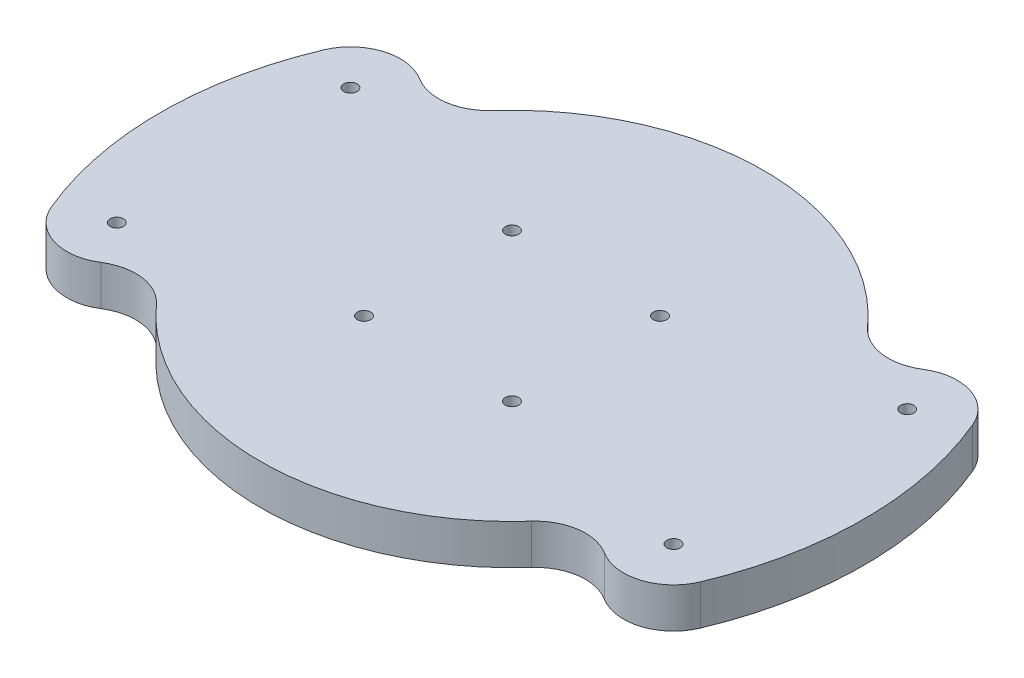
ISO-10303-21;
HEADER;
FILE_DESCRIPTION(('STEP AP214'),'2;1');
FILE_NAME('part.step','',(''),(''),'','','');
FILE_SCHEMA(('AUTOMOTIVE_DESIGN { 1 0 10303 214 1 1 1 1 }'));
ENDSEC;
DATA;
#1=APPLICATION_CONTEXT('core data for automotive mechanical design processes');
#2=APPLICATION_PROTOCOL_DEFINITION('international standard','automotive_design',2000,#1);
#3=PRODUCT_CONTEXT('',#1,'mechanical');
#4=PRODUCT('Part','Part','',(#3));
#5=PRODUCT_RELATED_PRODUCT_CATEGORY('part','',(#4));
#6=PRODUCT_DEFINITION_FORMATION('','',#4);
#7=PRODUCT_DEFINITION_CONTEXT('part definition',#1,'design');
#8=PRODUCT_DEFINITION('design','',#6,#7);
#9=PRODUCT_DEFINITION_SHAPE('','',#8);
#10=(LENGTH_UNIT() NAMED_UNIT(*) SI_UNIT(.MILLI.,.METRE.));
#11=(NAMED_UNIT(*) PLANE_ANGLE_UNIT() SI_UNIT($,.RADIAN.));
#12=(NAMED_UNIT(*) SI_UNIT($,.STERADIAN.) SOLID_ANGLE_UNIT());
#13=UNCERTAINTY_MEASURE_WITH_UNIT(LENGTH_MEASURE(1.E-05),#10,'distance_accuracy_value','');
#14=(GEOMETRIC_REPRESENTATION_CONTEXT(3) GLOBAL_UNCERTAINTY_ASSIGNED_CONTEXT((#13)) GLOBAL_UNIT_ASSIGNED_CONTEXT((#10,
#11,#12)) REPRESENTATION_CONTEXT('',''));
#15=CARTESIAN_POINT('',(0.,0.,0.));
#16=DIRECTION('',(0.,0.,1.));
#17=DIRECTION('',(1.,0.,0.));
#18=AXIS2_PLACEMENT_3D('',#15,#16,#17);
#19=CARTESIAN_POINT('',(0.,6.,0.));
#20=DIRECTION('',(0.,-1.,0.));
#21=DIRECTION('',(0.,0.,-1.));
#22=AXIS2_PLACEMENT_3D('',#19,#20,#21);
#23=PLANE('',#22);
#24=CARTESIAN_POINT('',(-41.7019259147584,6.,-17.5));
#25=DIRECTION('',(0.,1.,0.));
#26=DIRECTION('',(0.,0.,-1.));
#27=AXIS2_PLACEMENT_3D('',#24,#25,#26);
#28=CIRCLE('',#27,0.999999999999998);
#29=CARTESIAN_POINT('',(-41.7019259147584,6.,-18.5));
#30=VERTEX_POINT('',#29);
#31=EDGE_CURVE('E362',#30,#30,#28,.T.);
#32=ORIENTED_EDGE('',*,*,#31,.F.);
#33=EDGE_LOOP('',(#32));
#34=FACE_BOUND('',#33,.T.);
#35=CARTESIAN_POINT('',(-11.0838987950991,6.,11.0838987950992));
#36=DIRECTION('',(0.,1.,0.));
#37=DIRECTION('',(0.,0.,1.));
#38=AXIS2_PLACEMENT_3D('',#35,#36,#37);
#39=CIRCLE('',#38,1.);
#40=CARTESIAN_POINT('',(-11.0838987950991,6.,12.0838987950992));
#41=VERTEX_POINT('',#40);
#42=EDGE_CURVE('E350',#41,#41,#39,.T.);
#43=ORIENTED_EDGE('',*,*,#42,.F.);
#44=EDGE_LOOP('',(#43));
#45=FACE_BOUND('',#44,.T.);
#46=CARTESIAN_POINT('',(11.0838987950991,6.,-11.0838987950992));
#47=DIRECTION('',(0.,1.,0.));
#48=DIRECTION('',(0.,0.,1.));
#49=AXIS2_PLACEMENT_3D('',#46,#47,#48);
#50=CIRCLE('',#49,0.999999999999999);
#51=CARTESIAN_POINT('',(11.0838987950991,6.,-10.0838987950992));
#52=VERTEX_POINT('',#51);
#53=EDGE_CURVE('E337',#52,#52,#50,.T.);
#54=ORIENTED_EDGE('',*,*,#53,.F.);
#55=EDGE_LOOP('',(#54));
#56=FACE_BOUND('',#55,.T.);
#57=CARTESIAN_POINT('',(-11.0838987950992,6.,-11.0838987950991));
#58=DIRECTION('',(0.,1.,0.));
#59=DIRECTION('',(0.,0.,1.));
#60=AXIS2_PLACEMENT_3D('',#57,#58,#59);
#61=CIRCLE('',#60,1.);
#62=CARTESIAN_POINT('',(-11.0838987950992,6.,-10.0838987950991));
#63=VERTEX_POINT('',#62);
#64=EDGE_CURVE('E154',#63,#63,#61,.T.);
#65=ORIENTED_EDGE('',*,*,#64,.F.);
#66=EDGE_LOOP('',(#65));
#67=FACE_BOUND('',#66,.T.);
#68=CARTESIAN_POINT('',(0.,6.,0.));
#69=DIRECTION('',(0.,1.,0.));
#70=DIRECTION('',(0.,0.,1.));
#71=AXIS2_PLACEMENT_3D('',#68,#69,#70);
#72=CIRCLE('',#71,37.725);
#73=CARTESIAN_POINT('',(-28.0981033127079,6.,25.1728467843506));
#74=VERTEX_POINT('',#73);
#75=CARTESIAN_POINT('',(28.0981033127079,6.,25.1728467843506));
#76=VERTEX_POINT('',#75);
#77=EDGE_CURVE('E163',#74,#76,#72,.T.);
#78=ORIENTED_EDGE('',*,*,#77,.T.);
#79=CARTESIAN_POINT('',(33.6842073510197,6.,30.1773888885953));
#80=DIRECTION('',(0.,-1.,0.));
#81=DIRECTION('',(0.,0.,-1.));
#82=AXIS2_PLACEMENT_3D('',#79,#80,#81);
#83=CIRCLE('',#82,7.5);
#84=CARTESIAN_POINT('',(37.693066632889,6.,23.8386944442976));
#85=VERTEX_POINT('',#84);
#86=EDGE_CURVE('E50',#76,#85,#83,.T.);
#87=ORIENTED_EDGE('',*,*,#86,.T.);
#88=CARTESIAN_POINT('',(41.7019259147584,6.,17.5));
#89=DIRECTION('',(0.,-1.,0.));
#90=DIRECTION('',(0.,0.,-1.));
#91=AXIS2_PLACEMENT_3D('',#88,#89,#90);
#92=CIRCLE('',#91,7.5);
#93=CARTESIAN_POINT('',(48.6176681891794,6.,20.4021558872305));
#94=VERTEX_POINT('',#93);
#95=EDGE_CURVE('E179',#85,#94,#92,.F.);
#96=ORIENTED_EDGE('',*,*,#95,.T.);
#97=CARTESIAN_POINT('',(0.,6.,0.));
#98=DIRECTION('',(0.,1.,0.));
#99=DIRECTION('',(0.,0.,-1.));
#100=AXIS2_PLACEMENT_3D('',#97,#98,#99);
#101=CIRCLE('',#100,52.725);
#102=CARTESIAN_POINT('',(48.6176681891794,6.,-20.4021558872305));
#103=VERTEX_POINT('',#102);
#104=EDGE_CURVE('E145',#94,#103,#101,.T.);
#105=ORIENTED_EDGE('',*,*,#104,.T.);
#106=CARTESIAN_POINT('',(41.7019259147584,6.,-17.5));
#107=DIRECTION('',(0.,-1.,0.));
#108=DIRECTION('',(0.,0.,-1.));
#109=AXIS2_PLACEMENT_3D('',#106,#107,#108);
#110=CIRCLE('',#109,7.5);
#111=CARTESIAN_POINT('',(37.693066632889,6.,-23.8386944442976));
#112=VERTEX_POINT('',#111);
#113=EDGE_CURVE('E175',#103,#112,#110,.F.);
#114=ORIENTED_EDGE('',*,*,#113,.T.);
#115=CARTESIAN_POINT('',(33.6842073510197,6.,-30.1773888885953));
#116=DIRECTION('',(0.,-1.,0.));
#117=DIRECTION('',(0.,0.,-1.));
#118=AXIS2_PLACEMENT_3D('',#115,#116,#117);
#119=CIRCLE('',#118,7.5);
#120=CARTESIAN_POINT('',(28.0981033127079,6.,-25.1728467843506));
#121=VERTEX_POINT('',#120);
#122=EDGE_CURVE('E203',#112,#121,#119,.T.);
#123=ORIENTED_EDGE('',*,*,#122,.T.);
#124=CARTESIAN_POINT('',(0.,6.,0.));
#125=DIRECTION('',(0.,1.,0.));
#126=DIRECTION('',(0.,0.,-1.));
#127=AXIS2_PLACEMENT_3D('',#124,#125,#126);
#128=CIRCLE('',#127,37.725);
#129=CARTESIAN_POINT('',(-28.0981033127079,6.,-25.1728467843506));
#130=VERTEX_POINT('',#129);
#131=EDGE_CURVE('E232',#121,#130,#128,.T.);
#132=ORIENTED_EDGE('',*,*,#131,.T.);
#133=CARTESIAN_POINT('',(-33.6842073510197,6.,-30.1773888885953));
#134=DIRECTION('',(0.,-1.,0.));
#135=DIRECTION('',(0.,0.,-1.));
#136=AXIS2_PLACEMENT_3D('',#133,#134,#135);
#137=CIRCLE('',#136,7.5);
#138=CARTESIAN_POINT('',(-37.693066632889,6.,-23.8386944442976));
#139=VERTEX_POINT('',#138);
#140=EDGE_CURVE('E11',#130,#139,#137,.T.);
#141=ORIENTED_EDGE('',*,*,#140,.T.);
#142=CARTESIAN_POINT('',(-41.7019259147584,6.,-17.5));
#143=DIRECTION('',(0.,-1.,0.));
#144=DIRECTION('',(0.,0.,-1.));
#145=AXIS2_PLACEMENT_3D('',#142,#143,#144);
#146=CIRCLE('',#145,7.5);
#147=CARTESIAN_POINT('',(-48.6176681891794,6.,-20.4021558872305));
#148=VERTEX_POINT('',#147);
#149=EDGE_CURVE('E134',#139,#148,#146,.F.);
#150=ORIENTED_EDGE('',*,*,#149,.T.);
#151=CARTESIAN_POINT('',(0.,6.,0.));
#152=DIRECTION('',(0.,1.,0.));
#153=DIRECTION('',(0.,0.,1.));
#154=AXIS2_PLACEMENT_3D('',#151,#152,#153);
#155=CIRCLE('',#154,52.725);
#156=CARTESIAN_POINT('',(-48.6176681891794,6.,20.4021558872305));
#157=VERTEX_POINT('',#156);
#158=EDGE_CURVE('E239',#148,#157,#155,.T.);
#159=ORIENTED_EDGE('',*,*,#158,.T.);
#160=CARTESIAN_POINT('',(-41.7019259147584,6.,17.5));
#161=DIRECTION('',(0.,-1.,0.));
#162=DIRECTION('',(0.,0.,-1.));
#163=AXIS2_PLACEMENT_3D('',#160,#161,#162);
#164=CIRCLE('',#163,7.5);
#165=CARTESIAN_POINT('',(-37.693066632889,6.,23.8386944442976));
#166=VERTEX_POINT('',#165);
#167=EDGE_CURVE('E177',#157,#166,#164,.F.);
#168=ORIENTED_EDGE('',*,*,#167,.T.);
#169=CARTESIAN_POINT('',(-33.6842073510197,6.,30.1773888885953));
#170=DIRECTION('',(0.,-1.,0.));
#171=DIRECTION('',(0.,0.,-1.));
#172=AXIS2_PLACEMENT_3D('',#169,#170,#171);
#173=CIRCLE('',#172,7.5);
#174=EDGE_CURVE('E199',#166,#74,#173,.T.);
#175=ORIENTED_EDGE('',*,*,#174,.T.);
#176=EDGE_LOOP('',(#78,#87,#96,#105,#114,#123,#132,#141,#150,#159,#168,#175));
#177=FACE_BOUND('',#176,.T.);
#178=CARTESIAN_POINT('',(41.7019259147584,6.,-17.5));
#179=DIRECTION('',(0.,1.,0.));
#180=DIRECTION('',(0.,0.,1.));
#181=AXIS2_PLACEMENT_3D('',#178,#179,#180);
#182=CIRCLE('',#181,0.999999999999998);
#183=CARTESIAN_POINT('',(41.7019259147584,6.,-16.5));
#184=VERTEX_POINT('',#183);
#185=EDGE_CURVE('E333',#184,#184,#182,.T.);
#186=ORIENTED_EDGE('',*,*,#185,.F.);
#187=EDGE_LOOP('',(#186));
#188=FACE_BOUND('',#187,.T.);
#189=CARTESIAN_POINT('',(11.0838987950992,6.,11.0838987950991));
#190=DIRECTION('',(0.,1.,0.));
#191=DIRECTION('',(0.,0.,1.));
#192=AXIS2_PLACEMENT_3D('',#189,#190,#191);
#193=CIRCLE('',#192,0.999999999999999);
#194=CARTESIAN_POINT('',(11.0838987950992,6.,12.0838987950991));
#195=VERTEX_POINT('',#194);
#196=EDGE_CURVE('E345',#195,#195,#193,.T.);
#197=ORIENTED_EDGE('',*,*,#196,.F.);
#198=EDGE_LOOP('',(#197));
#199=FACE_BOUND('',#198,.T.);
#200=CARTESIAN_POINT('',(41.7019259147584,6.,17.5));
#201=DIRECTION('',(0.,1.,0.));
#202=DIRECTION('',(0.,0.,1.));
#203=AXIS2_PLACEMENT_3D('',#200,#201,#202);
#204=CIRCLE('',#203,0.999999999999998);
#205=CARTESIAN_POINT('',(41.7019259147584,6.,18.5));
#206=VERTEX_POINT('',#205);
#207=EDGE_CURVE('E356',#206,#206,#204,.T.);
#208=ORIENTED_EDGE('',*,*,#207,.F.);
#209=EDGE_LOOP('',(#208));
#210=FACE_BOUND('',#209,.T.);
#211=CARTESIAN_POINT('',(-41.7019259147584,6.,17.5));
#212=DIRECTION('',(0.,1.,0.));
#213=DIRECTION('',(0.,0.,-1.));
#214=AXIS2_PLACEMENT_3D('',#211,#212,#213);
#215=CIRCLE('',#214,0.999999999999998);
#216=CARTESIAN_POINT('',(-41.7019259147584,6.,16.5));
#217=VERTEX_POINT('',#216);
#218=EDGE_CURVE('E368',#217,#217,#215,.T.);
#219=ORIENTED_EDGE('',*,*,#218,.F.);
#220=EDGE_LOOP('',(#219));
#221=FACE_BOUND('',#220,.T.);
#222=ADVANCED_FACE('F33',(#34,#45,#56,#67,#177,#188,#199,#210,#221),#23,.F.);
#223=CARTESIAN_POINT('',(0.,0.,0.));
#224=DIRECTION('',(0.,-1.,0.));
#225=DIRECTION('',(0.,0.,-1.));
#226=AXIS2_PLACEMENT_3D('',#223,#224,#225);
#227=PLANE('',#226);
#228=CARTESIAN_POINT('',(-41.7019259147584,0.,-17.5));
#229=DIRECTION('',(0.,1.,0.));
#230=DIRECTION('',(0.,0.,-1.));
#231=AXIS2_PLACEMENT_3D('',#228,#229,#230);
#232=CIRCLE('',#231,0.999999999999998);
#233=CARTESIAN_POINT('',(-41.7019259147584,0.,-18.5));
#234=VERTEX_POINT('',#233);
#235=EDGE_CURVE('E365',#234,#234,#232,.T.);
#236=ORIENTED_EDGE('',*,*,#235,.T.);
#237=EDGE_LOOP('',(#236));
#238=FACE_BOUND('',#237,.T.);
#239=CARTESIAN_POINT('',(-11.0838987950991,0.,11.0838987950992));
#240=DIRECTION('',(0.,1.,0.));
#241=DIRECTION('',(0.,0.,1.));
#242=AXIS2_PLACEMENT_3D('',#239,#240,#241);
#243=CIRCLE('',#242,1.);
#244=CARTESIAN_POINT('',(-11.0838987950991,0.,12.0838987950992));
#245=VERTEX_POINT('',#244);
#246=EDGE_CURVE('E353',#245,#245,#243,.T.);
#247=ORIENTED_EDGE('',*,*,#246,.T.);
#248=EDGE_LOOP('',(#247));
#249=FACE_BOUND('',#248,.T.);
#250=CARTESIAN_POINT('',(11.0838987950991,0.,-11.0838987950992));
#251=DIRECTION('',(0.,1.,0.));
#252=DIRECTION('',(0.,0.,1.));
#253=AXIS2_PLACEMENT_3D('',#250,#251,#252);
#254=CIRCLE('',#253,0.999999999999999);
#255=CARTESIAN_POINT('',(11.0838987950991,0.,-10.0838987950992));
#256=VERTEX_POINT('',#255);
#257=EDGE_CURVE('E341',#256,#256,#254,.T.);
#258=ORIENTED_EDGE('',*,*,#257,.T.);
#259=EDGE_LOOP('',(#258));
#260=FACE_BOUND('',#259,.T.);
#261=CARTESIAN_POINT('',(-11.0838987950992,0.,-11.0838987950991));
#262=DIRECTION('',(0.,1.,0.));
#263=DIRECTION('',(0.,0.,1.));
#264=AXIS2_PLACEMENT_3D('',#261,#262,#263);
#265=CIRCLE('',#264,1.);
#266=CARTESIAN_POINT('',(-11.0838987950992,0.,-10.0838987950991));
#267=VERTEX_POINT('',#266);
#268=EDGE_CURVE('E160',#267,#267,#265,.T.);
#269=ORIENTED_EDGE('',*,*,#268,.T.);
#270=EDGE_LOOP('',(#269));
#271=FACE_BOUND('',#270,.T.);
#272=CARTESIAN_POINT('',(0.,0.,0.));
#273=DIRECTION('',(0.,1.,0.));
#274=DIRECTION('',(0.,0.,-1.));
#275=AXIS2_PLACEMENT_3D('',#272,#273,#274);
#276=CIRCLE('',#275,52.725);
#277=CARTESIAN_POINT('',(48.6176681891794,0.,20.4021558872305));
#278=VERTEX_POINT('',#277);
#279=CARTESIAN_POINT('',(48.6176681891794,0.,-20.4021558872305));
#280=VERTEX_POINT('',#279);
#281=EDGE_CURVE('E142',#278,#280,#276,.T.);
#282=ORIENTED_EDGE('',*,*,#281,.F.);
#283=CARTESIAN_POINT('',(41.7019259147584,0.,17.5));
#284=DIRECTION('',(0.,-1.,0.));
#285=DIRECTION('',(0.,0.,-1.));
#286=AXIS2_PLACEMENT_3D('',#283,#284,#285);
#287=CIRCLE('',#286,7.5);
#288=CARTESIAN_POINT('',(37.693066632889,0.,23.8386944442976));
#289=VERTEX_POINT('',#288);
#290=EDGE_CURVE('E125',#278,#289,#287,.T.);
#291=ORIENTED_EDGE('',*,*,#290,.T.);
#292=CARTESIAN_POINT('',(33.6842073510197,0.,30.1773888885953));
#293=DIRECTION('',(0.,-1.,0.));
#294=DIRECTION('',(0.,0.,-1.));
#295=AXIS2_PLACEMENT_3D('',#292,#293,#294);
#296=CIRCLE('',#295,7.5);
#297=CARTESIAN_POINT('',(28.0981033127079,0.,25.1728467843506));
#298=VERTEX_POINT('',#297);
#299=EDGE_CURVE('E194',#289,#298,#296,.F.);
#300=ORIENTED_EDGE('',*,*,#299,.T.);
#301=CARTESIAN_POINT('',(0.,0.,0.));
#302=DIRECTION('',(0.,1.,0.));
#303=DIRECTION('',(0.,0.,1.));
#304=AXIS2_PLACEMENT_3D('',#301,#302,#303);
#305=CIRCLE('',#304,37.725);
#306=CARTESIAN_POINT('',(-28.0981033127079,0.,25.1728467843506));
#307=VERTEX_POINT('',#306);
#308=EDGE_CURVE('E168',#307,#298,#305,.T.);
#309=ORIENTED_EDGE('',*,*,#308,.F.);
#310=CARTESIAN_POINT('',(-33.6842073510197,0.,30.1773888885953));
#311=DIRECTION('',(0.,-1.,0.));
#312=DIRECTION('',(0.,0.,-1.));
#313=AXIS2_PLACEMENT_3D('',#310,#311,#312);
#314=CIRCLE('',#313,7.5);
#315=CARTESIAN_POINT('',(-37.693066632889,0.,23.8386944442976));
#316=VERTEX_POINT('',#315);
#317=EDGE_CURVE('E197',#307,#316,#314,.F.);
#318=ORIENTED_EDGE('',*,*,#317,.T.);
#319=CARTESIAN_POINT('',(-41.7019259147584,0.,17.5));
#320=DIRECTION('',(0.,-1.,0.));
#321=DIRECTION('',(0.,0.,-1.));
#322=AXIS2_PLACEMENT_3D('',#319,#320,#321);
#323=CIRCLE('',#322,7.5);
#324=CARTESIAN_POINT('',(-48.6176681891794,0.,20.4021558872305));
#325=VERTEX_POINT('',#324);
#326=EDGE_CURVE('E135',#316,#325,#323,.T.);
#327=ORIENTED_EDGE('',*,*,#326,.T.);
#328=CARTESIAN_POINT('',(0.,0.,0.));
#329=DIRECTION('',(0.,1.,0.));
#330=DIRECTION('',(0.,0.,1.));
#331=AXIS2_PLACEMENT_3D('',#328,#329,#330);
#332=CIRCLE('',#331,52.725);
#333=CARTESIAN_POINT('',(-48.6176681891794,0.,-20.4021558872305));
#334=VERTEX_POINT('',#333);
#335=EDGE_CURVE('E157',#334,#325,#332,.T.);
#336=ORIENTED_EDGE('',*,*,#335,.F.);
#337=CARTESIAN_POINT('',(-41.7019259147584,0.,-17.5));
#338=DIRECTION('',(0.,-1.,0.));
#339=DIRECTION('',(0.,0.,-1.));
#340=AXIS2_PLACEMENT_3D('',#337,#338,#339);
#341=CIRCLE('',#340,7.5);
#342=CARTESIAN_POINT('',(-37.693066632889,0.,-23.8386944442976));
#343=VERTEX_POINT('',#342);
#344=EDGE_CURVE('E146',#334,#343,#341,.T.);
#345=ORIENTED_EDGE('',*,*,#344,.T.);
#346=CARTESIAN_POINT('',(-33.6842073510197,0.,-30.1773888885953));
#347=DIRECTION('',(0.,-1.,0.));
#348=DIRECTION('',(0.,0.,-1.));
#349=AXIS2_PLACEMENT_3D('',#346,#347,#348);
#350=CIRCLE('',#349,7.5);
#351=CARTESIAN_POINT('',(-28.0981033127079,0.,-25.1728467843506));
#352=VERTEX_POINT('',#351);
#353=EDGE_CURVE('E42',#343,#352,#350,.F.);
#354=ORIENTED_EDGE('',*,*,#353,.T.);
#355=CARTESIAN_POINT('',(0.,0.,0.));
#356=DIRECTION('',(0.,1.,0.));
#357=DIRECTION('',(0.,0.,-1.));
#358=AXIS2_PLACEMENT_3D('',#355,#356,#357);
#359=CIRCLE('',#358,37.725);
#360=CARTESIAN_POINT('',(28.0981033127079,0.,-25.1728467843506));
#361=VERTEX_POINT('',#360);
#362=EDGE_CURVE('E153',#361,#352,#359,.T.);
#363=ORIENTED_EDGE('',*,*,#362,.F.);
#364=CARTESIAN_POINT('',(33.6842073510197,0.,-30.1773888885953));
#365=DIRECTION('',(0.,-1.,0.));
#366=DIRECTION('',(0.,0.,-1.));
#367=AXIS2_PLACEMENT_3D('',#364,#365,#366);
#368=CIRCLE('',#367,7.5);
#369=CARTESIAN_POINT('',(37.693066632889,0.,-23.8386944442976));
#370=VERTEX_POINT('',#369);
#371=EDGE_CURVE('E201',#361,#370,#368,.F.);
#372=ORIENTED_EDGE('',*,*,#371,.T.);
#373=CARTESIAN_POINT('',(41.7019259147584,0.,-17.5));
#374=DIRECTION('',(0.,-1.,0.));
#375=DIRECTION('',(0.,0.,-1.));
#376=AXIS2_PLACEMENT_3D('',#373,#374,#375);
#377=CIRCLE('',#376,7.5);
#378=EDGE_CURVE('E152',#370,#280,#377,.T.);
#379=ORIENTED_EDGE('',*,*,#378,.T.);
#380=EDGE_LOOP('',(#282,#291,#300,#309,#318,#327,#336,#345,#354,#363,#372,#379));
#381=FACE_BOUND('',#380,.T.);
#382=CARTESIAN_POINT('',(41.7019259147584,0.,-17.5));
#383=DIRECTION('',(0.,1.,0.));
#384=DIRECTION('',(0.,0.,1.));
#385=AXIS2_PLACEMENT_3D('',#382,#383,#384);
#386=CIRCLE('',#385,0.999999999999998);
#387=CARTESIAN_POINT('',(41.7019259147584,0.,-16.5));
#388=VERTEX_POINT('',#387);
#389=EDGE_CURVE('E336',#388,#388,#386,.T.);
#390=ORIENTED_EDGE('',*,*,#389,.T.);
#391=EDGE_LOOP('',(#390));
#392=FACE_BOUND('',#391,.T.);
#393=CARTESIAN_POINT('',(11.0838987950992,0.,11.0838987950991));
#394=DIRECTION('',(0.,1.,0.));
#395=DIRECTION('',(0.,0.,1.));
#396=AXIS2_PLACEMENT_3D('',#393,#394,#395);
#397=CIRCLE('',#396,0.999999999999999);
#398=CARTESIAN_POINT('',(11.0838987950992,0.,12.0838987950991));
#399=VERTEX_POINT('',#398);
#400=EDGE_CURVE('E347',#399,#399,#397,.T.);
#401=ORIENTED_EDGE('',*,*,#400,.T.);
#402=EDGE_LOOP('',(#401));
#403=FACE_BOUND('',#402,.T.);
#404=CARTESIAN_POINT('',(41.7019259147584,0.,17.5));
#405=DIRECTION('',(0.,1.,0.));
#406=DIRECTION('',(0.,0.,1.));
#407=AXIS2_PLACEMENT_3D('',#404,#405,#406);
#408=CIRCLE('',#407,0.999999999999998);
#409=CARTESIAN_POINT('',(41.7019259147584,0.,18.5));
#410=VERTEX_POINT('',#409);
#411=EDGE_CURVE('E359',#410,#410,#408,.T.);
#412=ORIENTED_EDGE('',*,*,#411,.T.);
#413=EDGE_LOOP('',(#412));
#414=FACE_BOUND('',#413,.T.);
#415=CARTESIAN_POINT('',(-41.7019259147584,0.,17.5));
#416=DIRECTION('',(0.,1.,0.));
#417=DIRECTION('',(0.,0.,-1.));
#418=AXIS2_PLACEMENT_3D('',#415,#416,#417);
#419=CIRCLE('',#418,0.999999999999998);
#420=CARTESIAN_POINT('',(-41.7019259147584,0.,16.5));
#421=VERTEX_POINT('',#420);
#422=EDGE_CURVE('E207',#421,#421,#419,.T.);
#423=ORIENTED_EDGE('',*,*,#422,.T.);
#424=EDGE_LOOP('',(#423));
#425=FACE_BOUND('',#424,.T.);
#426=ADVANCED_FACE('F149',(#238,#249,#260,#271,#381,#392,#403,#414,#425),#227,.T.);
#427=CARTESIAN_POINT('',(0.,6.,0.));
#428=DIRECTION('',(0.,-1.,0.));
#429=DIRECTION('',(0.,0.,-1.));
#430=AXIS2_PLACEMENT_3D('',#427,#428,#429);
#431=CYLINDRICAL_SURFACE('',#430,52.725);
#432=ORIENTED_EDGE('',*,*,#104,.F.);
#433=DIRECTION('',(0.,-1.,0.));
#434=VECTOR('',#433,1.);
#435=CARTESIAN_POINT('',(48.6176681891794,6.,20.4021558872305));
#436=LINE('',#435,#434);
#437=EDGE_CURVE('E129',#94,#278,#436,.T.);
#438=ORIENTED_EDGE('',*,*,#437,.T.);
#439=ORIENTED_EDGE('',*,*,#281,.T.);
#440=DIRECTION('',(0.,-1.,0.));
#441=VECTOR('',#440,1.);
#442=CARTESIAN_POINT('',(48.6176681891794,6.,-20.4021558872305));
#443=LINE('',#442,#441);
#444=EDGE_CURVE('E147',#280,#103,#443,.F.);
#445=ORIENTED_EDGE('',*,*,#444,.T.);
#446=EDGE_LOOP('',(#432,#438,#439,#445));
#447=FACE_BOUND('',#446,.T.);
#448=ADVANCED_FACE('F140',(#447),#431,.T.);
#449=CARTESIAN_POINT('',(0.,6.,0.));
#450=DIRECTION('',(0.,-1.,0.));
#451=DIRECTION('',(0.,0.,-1.));
#452=AXIS2_PLACEMENT_3D('',#449,#450,#451);
#453=CYLINDRICAL_SURFACE('',#452,37.725);
#454=ORIENTED_EDGE('',*,*,#131,.F.);
#455=DIRECTION('',(0.,-1.,0.));
#456=VECTOR('',#455,1.);
#457=CARTESIAN_POINT('',(28.0981033127079,6.,-25.1728467843506));
#458=LINE('',#457,#456);
#459=EDGE_CURVE('E192',#121,#361,#458,.T.);
#460=ORIENTED_EDGE('',*,*,#459,.T.);
#461=ORIENTED_EDGE('',*,*,#362,.T.);
#462=DIRECTION('',(0.,-1.,0.));
#463=VECTOR('',#462,1.);
#464=CARTESIAN_POINT('',(-28.0981033127079,6.,-25.1728467843506));
#465=LINE('',#464,#463);
#466=EDGE_CURVE('E190',#352,#130,#465,.F.);
#467=ORIENTED_EDGE('',*,*,#466,.T.);
#468=EDGE_LOOP('',(#454,#460,#461,#467));
#469=FACE_BOUND('',#468,.T.);
#470=ADVANCED_FACE('F229',(#469),#453,.T.);
#471=CARTESIAN_POINT('',(0.,6.,0.));
#472=DIRECTION('',(0.,-1.,0.));
#473=DIRECTION('',(0.,0.,-1.));
#474=AXIS2_PLACEMENT_3D('',#471,#472,#473);
#475=CYLINDRICAL_SURFACE('',#474,52.725);
#476=ORIENTED_EDGE('',*,*,#335,.T.);
#477=DIRECTION('',(0.,-1.,0.));
#478=VECTOR('',#477,1.);
#479=CARTESIAN_POINT('',(-48.6176681891794,6.,20.4021558872305));
#480=LINE('',#479,#478);
#481=EDGE_CURVE('E187',#325,#157,#480,.F.);
#482=ORIENTED_EDGE('',*,*,#481,.T.);
#483=ORIENTED_EDGE('',*,*,#158,.F.);
#484=DIRECTION('',(0.,-1.,0.));
#485=VECTOR('',#484,1.);
#486=CARTESIAN_POINT('',(-48.6176681891794,6.,-20.4021558872305));
#487=LINE('',#486,#485);
#488=EDGE_CURVE('E184',#148,#334,#487,.T.);
#489=ORIENTED_EDGE('',*,*,#488,.T.);
#490=EDGE_LOOP('',(#476,#482,#483,#489));
#491=FACE_BOUND('',#490,.T.);
#492=ADVANCED_FACE('F258',(#491),#475,.T.);
#493=CARTESIAN_POINT('',(0.,6.,0.));
#494=DIRECTION('',(0.,-1.,0.));
#495=DIRECTION('',(0.,0.,-1.));
#496=AXIS2_PLACEMENT_3D('',#493,#494,#495);
#497=CYLINDRICAL_SURFACE('',#496,37.725);
#498=ORIENTED_EDGE('',*,*,#308,.T.);
#499=DIRECTION('',(0.,-1.,0.));
#500=VECTOR('',#499,1.);
#501=CARTESIAN_POINT('',(28.0981033127079,6.,25.1728467843506));
#502=LINE('',#501,#500);
#503=EDGE_CURVE('E58',#298,#76,#502,.F.);
#504=ORIENTED_EDGE('',*,*,#503,.T.);
#505=ORIENTED_EDGE('',*,*,#77,.F.);
#506=DIRECTION('',(0.,-1.,0.));
#507=VECTOR('',#506,1.);
#508=CARTESIAN_POINT('',(-28.0981033127079,6.,25.1728467843506));
#509=LINE('',#508,#507);
#510=EDGE_CURVE('E181',#74,#307,#509,.T.);
#511=ORIENTED_EDGE('',*,*,#510,.T.);
#512=EDGE_LOOP('',(#498,#504,#505,#511));
#513=FACE_BOUND('',#512,.T.);
#514=ADVANCED_FACE('F250',(#513),#497,.T.);
#515=CARTESIAN_POINT('',(-11.0838987950992,6.,-11.0838987950991));
#516=DIRECTION('',(0.,-1.,0.));
#517=DIRECTION('',(0.,0.,-1.));
#518=AXIS2_PLACEMENT_3D('',#515,#516,#517);
#519=CYLINDRICAL_SURFACE('',#518,1.);
#520=ORIENTED_EDGE('',*,*,#64,.T.);
#521=EDGE_LOOP('',(#520));
#522=FACE_BOUND('',#521,.T.);
#523=ORIENTED_EDGE('',*,*,#268,.F.);
#524=EDGE_LOOP('',(#523));
#525=FACE_BOUND('',#524,.T.);
#526=ADVANCED_FACE('F280',(#522,#525),#519,.F.);
#527=CARTESIAN_POINT('',(41.7019259147584,6.,-17.5));
#528=DIRECTION('',(0.,-1.,0.));
#529=DIRECTION('',(0.,0.,-1.));
#530=AXIS2_PLACEMENT_3D('',#527,#528,#529);
#531=CYLINDRICAL_SURFACE('',#530,0.999999999999998);
#532=ORIENTED_EDGE('',*,*,#185,.T.);
#533=EDGE_LOOP('',(#532));
#534=FACE_BOUND('',#533,.T.);
#535=ORIENTED_EDGE('',*,*,#389,.F.);
#536=EDGE_LOOP('',(#535));
#537=FACE_BOUND('',#536,.T.);
#538=ADVANCED_FACE('F322',(#534,#537),#531,.F.);
#539=CARTESIAN_POINT('',(11.0838987950991,6.,-11.0838987950992));
#540=DIRECTION('',(0.,-1.,0.));
#541=DIRECTION('',(0.,0.,-1.));
#542=AXIS2_PLACEMENT_3D('',#539,#540,#541);
#543=CYLINDRICAL_SURFACE('',#542,0.999999999999999);
#544=ORIENTED_EDGE('',*,*,#53,.T.);
#545=EDGE_LOOP('',(#544));
#546=FACE_BOUND('',#545,.T.);
#547=ORIENTED_EDGE('',*,*,#257,.F.);
#548=EDGE_LOOP('',(#547));
#549=FACE_BOUND('',#548,.T.);
#550=ADVANCED_FACE('F319',(#546,#549),#543,.F.);
#551=CARTESIAN_POINT('',(11.0838987950992,6.,11.0838987950991));
#552=DIRECTION('',(0.,-1.,0.));
#553=DIRECTION('',(0.,0.,-1.));
#554=AXIS2_PLACEMENT_3D('',#551,#552,#553);
#555=CYLINDRICAL_SURFACE('',#554,0.999999999999999);
#556=ORIENTED_EDGE('',*,*,#196,.T.);
#557=EDGE_LOOP('',(#556));
#558=FACE_BOUND('',#557,.T.);
#559=ORIENTED_EDGE('',*,*,#400,.F.);
#560=EDGE_LOOP('',(#559));
#561=FACE_BOUND('',#560,.T.);
#562=ADVANCED_FACE('F315',(#558,#561),#555,.F.);
#563=CARTESIAN_POINT('',(-11.0838987950991,6.,11.0838987950992));
#564=DIRECTION('',(0.,-1.,0.));
#565=DIRECTION('',(0.,0.,-1.));
#566=AXIS2_PLACEMENT_3D('',#563,#564,#565);
#567=CYLINDRICAL_SURFACE('',#566,1.);
#568=ORIENTED_EDGE('',*,*,#42,.T.);
#569=EDGE_LOOP('',(#568));
#570=FACE_BOUND('',#569,.T.);
#571=ORIENTED_EDGE('',*,*,#246,.F.);
#572=EDGE_LOOP('',(#571));
#573=FACE_BOUND('',#572,.T.);
#574=ADVANCED_FACE('F311',(#570,#573),#567,.F.);
#575=CARTESIAN_POINT('',(41.7019259147584,6.,17.5));
#576=DIRECTION('',(0.,-1.,0.));
#577=DIRECTION('',(0.,0.,-1.));
#578=AXIS2_PLACEMENT_3D('',#575,#576,#577);
#579=CYLINDRICAL_SURFACE('',#578,0.999999999999998);
#580=ORIENTED_EDGE('',*,*,#207,.T.);
#581=EDGE_LOOP('',(#580));
#582=FACE_BOUND('',#581,.T.);
#583=ORIENTED_EDGE('',*,*,#411,.F.);
#584=EDGE_LOOP('',(#583));
#585=FACE_BOUND('',#584,.T.);
#586=ADVANCED_FACE('F303',(#582,#585),#579,.F.);
#587=CARTESIAN_POINT('',(-41.7019259147584,6.,-17.5));
#588=DIRECTION('',(0.,-1.,0.));
#589=DIRECTION('',(0.,0.,-1.));
#590=AXIS2_PLACEMENT_3D('',#587,#588,#589);
#591=CYLINDRICAL_SURFACE('',#590,0.999999999999998);
#592=ORIENTED_EDGE('',*,*,#31,.T.);
#593=EDGE_LOOP('',(#592));
#594=FACE_BOUND('',#593,.T.);
#595=ORIENTED_EDGE('',*,*,#235,.F.);
#596=EDGE_LOOP('',(#595));
#597=FACE_BOUND('',#596,.T.);
#598=ADVANCED_FACE('F297',(#594,#597),#591,.F.);
#599=CARTESIAN_POINT('',(-41.7019259147584,6.,17.5));
#600=DIRECTION('',(0.,-1.,0.));
#601=DIRECTION('',(0.,0.,-1.));
#602=AXIS2_PLACEMENT_3D('',#599,#600,#601);
#603=CYLINDRICAL_SURFACE('',#602,0.999999999999998);
#604=ORIENTED_EDGE('',*,*,#218,.T.);
#605=EDGE_LOOP('',(#604));
#606=FACE_BOUND('',#605,.T.);
#607=ORIENTED_EDGE('',*,*,#422,.F.);
#608=EDGE_LOOP('',(#607));
#609=FACE_BOUND('',#608,.T.);
#610=ADVANCED_FACE('F293',(#606,#609),#603,.F.);
#611=CARTESIAN_POINT('',(33.6842073510197,6.,30.1773888885953));
#612=DIRECTION('',(0.,-1.,0.));
#613=DIRECTION('',(0.,0.,-1.));
#614=AXIS2_PLACEMENT_3D('',#611,#612,#613);
#615=CYLINDRICAL_SURFACE('',#614,7.5);
#616=DIRECTION('',(0.,1.,0.));
#617=VECTOR('',#616,1.);
#618=CARTESIAN_POINT('',(37.693066632889,0.,23.8386944442976));
#619=LINE('',#618,#617);
#620=EDGE_CURVE('E130',#85,#289,#619,.F.);
#621=ORIENTED_EDGE('',*,*,#620,.F.);
#622=ORIENTED_EDGE('',*,*,#86,.F.);
#623=ORIENTED_EDGE('',*,*,#503,.F.);
#624=ORIENTED_EDGE('',*,*,#299,.F.);
#625=EDGE_LOOP('',(#621,#622,#623,#624));
#626=FACE_BOUND('',#625,.T.);
#627=ADVANCED_FACE('F247',(#626),#615,.F.);
#628=CARTESIAN_POINT('',(41.7019259147584,6.,17.5));
#629=DIRECTION('',(0.,-1.,0.));
#630=DIRECTION('',(0.,0.,-1.));
#631=AXIS2_PLACEMENT_3D('',#628,#629,#630);
#632=CYLINDRICAL_SURFACE('',#631,7.5);
#633=ORIENTED_EDGE('',*,*,#95,.F.);
#634=ORIENTED_EDGE('',*,*,#620,.T.);
#635=ORIENTED_EDGE('',*,*,#290,.F.);
#636=ORIENTED_EDGE('',*,*,#437,.F.);
#637=EDGE_LOOP('',(#633,#634,#635,#636));
#638=FACE_BOUND('',#637,.T.);
#639=ADVANCED_FACE('F128',(#638),#632,.T.);
#640=CARTESIAN_POINT('',(-33.6842073510197,6.,30.1773888885953));
#641=DIRECTION('',(0.,-1.,0.));
#642=DIRECTION('',(0.,0.,-1.));
#643=AXIS2_PLACEMENT_3D('',#640,#641,#642);
#644=CYLINDRICAL_SURFACE('',#643,7.5);
#645=ORIENTED_EDGE('',*,*,#510,.F.);
#646=ORIENTED_EDGE('',*,*,#174,.F.);
#647=DIRECTION('',(0.,1.,0.));
#648=VECTOR('',#647,1.);
#649=CARTESIAN_POINT('',(-37.693066632889,6.,23.8386944442976));
#650=LINE('',#649,#648);
#651=EDGE_CURVE('E208',#316,#166,#650,.T.);
#652=ORIENTED_EDGE('',*,*,#651,.F.);
#653=ORIENTED_EDGE('',*,*,#317,.F.);
#654=EDGE_LOOP('',(#645,#646,#652,#653));
#655=FACE_BOUND('',#654,.T.);
#656=ADVANCED_FACE('F252',(#655),#644,.F.);
#657=CARTESIAN_POINT('',(-41.7019259147584,6.,17.5));
#658=DIRECTION('',(0.,-1.,0.));
#659=DIRECTION('',(0.,0.,-1.));
#660=AXIS2_PLACEMENT_3D('',#657,#658,#659);
#661=CYLINDRICAL_SURFACE('',#660,7.5);
#662=ORIENTED_EDGE('',*,*,#167,.F.);
#663=ORIENTED_EDGE('',*,*,#481,.F.);
#664=ORIENTED_EDGE('',*,*,#326,.F.);
#665=ORIENTED_EDGE('',*,*,#651,.T.);
#666=EDGE_LOOP('',(#662,#663,#664,#665));
#667=FACE_BOUND('',#666,.T.);
#668=ADVANCED_FACE('F259',(#667),#661,.T.);
#669=CARTESIAN_POINT('',(33.6842073510197,6.,-30.1773888885953));
#670=DIRECTION('',(0.,-1.,0.));
#671=DIRECTION('',(0.,0.,-1.));
#672=AXIS2_PLACEMENT_3D('',#669,#670,#671);
#673=CYLINDRICAL_SURFACE('',#672,7.5);
#674=ORIENTED_EDGE('',*,*,#459,.F.);
#675=ORIENTED_EDGE('',*,*,#122,.F.);
#676=DIRECTION('',(0.,1.,0.));
#677=VECTOR('',#676,1.);
#678=CARTESIAN_POINT('',(37.693066632889,6.,-23.8386944442976));
#679=LINE('',#678,#677);
#680=EDGE_CURVE('E210',#370,#112,#679,.T.);
#681=ORIENTED_EDGE('',*,*,#680,.F.);
#682=ORIENTED_EDGE('',*,*,#371,.F.);
#683=EDGE_LOOP('',(#674,#675,#681,#682));
#684=FACE_BOUND('',#683,.T.);
#685=ADVANCED_FACE('F235',(#684),#673,.F.);
#686=CARTESIAN_POINT('',(41.7019259147584,6.,-17.5));
#687=DIRECTION('',(0.,-1.,0.));
#688=DIRECTION('',(0.,0.,-1.));
#689=AXIS2_PLACEMENT_3D('',#686,#687,#688);
#690=CYLINDRICAL_SURFACE('',#689,7.5);
#691=ORIENTED_EDGE('',*,*,#113,.F.);
#692=ORIENTED_EDGE('',*,*,#444,.F.);
#693=ORIENTED_EDGE('',*,*,#378,.F.);
#694=ORIENTED_EDGE('',*,*,#680,.T.);
#695=EDGE_LOOP('',(#691,#692,#693,#694));
#696=FACE_BOUND('',#695,.T.);
#697=ADVANCED_FACE('F236',(#696),#690,.T.);
#698=CARTESIAN_POINT('',(-33.6842073510197,6.,-30.1773888885953));
#699=DIRECTION('',(0.,-1.,0.));
#700=DIRECTION('',(0.,0.,-1.));
#701=AXIS2_PLACEMENT_3D('',#698,#699,#700);
#702=CYLINDRICAL_SURFACE('',#701,7.5);
#703=DIRECTION('',(0.,1.,0.));
#704=VECTOR('',#703,1.);
#705=CARTESIAN_POINT('',(-37.693066632889,0.,-23.8386944442976));
#706=LINE('',#705,#704);
#707=EDGE_CURVE('E37',#139,#343,#706,.F.);
#708=ORIENTED_EDGE('',*,*,#707,.F.);
#709=ORIENTED_EDGE('',*,*,#140,.F.);
#710=ORIENTED_EDGE('',*,*,#466,.F.);
#711=ORIENTED_EDGE('',*,*,#353,.F.);
#712=EDGE_LOOP('',(#708,#709,#710,#711));
#713=FACE_BOUND('',#712,.T.);
#714=ADVANCED_FACE('F35',(#713),#702,.F.);
#715=CARTESIAN_POINT('',(-41.7019259147584,6.,-17.5));
#716=DIRECTION('',(0.,-1.,0.));
#717=DIRECTION('',(0.,0.,-1.));
#718=AXIS2_PLACEMENT_3D('',#715,#716,#717);
#719=CYLINDRICAL_SURFACE('',#718,7.5);
#720=ORIENTED_EDGE('',*,*,#149,.F.);
#721=ORIENTED_EDGE('',*,*,#707,.T.);
#722=ORIENTED_EDGE('',*,*,#344,.F.);
#723=ORIENTED_EDGE('',*,*,#488,.F.);
#724=EDGE_LOOP('',(#720,#721,#722,#723));
#725=FACE_BOUND('',#724,.T.);
#726=ADVANCED_FACE('F218',(#725),#719,.T.);
#727=CLOSED_SHELL('',(#222,#426,#448,#470,#492,#514,#526,#538,#550,#562,#574,#586,#598,#610,
#627,#639,#656,#668,#685,#697,#714,#726));
#728=MANIFOLD_SOLID_BREP('B2',#727);
#729=ADVANCED_BREP_SHAPE_REPRESENTATION('',(#18,#728),#14);
#730=SHAPE_DEFINITION_REPRESENTATION(#9,#729);
ENDSEC;
END-ISO-10303-21;
